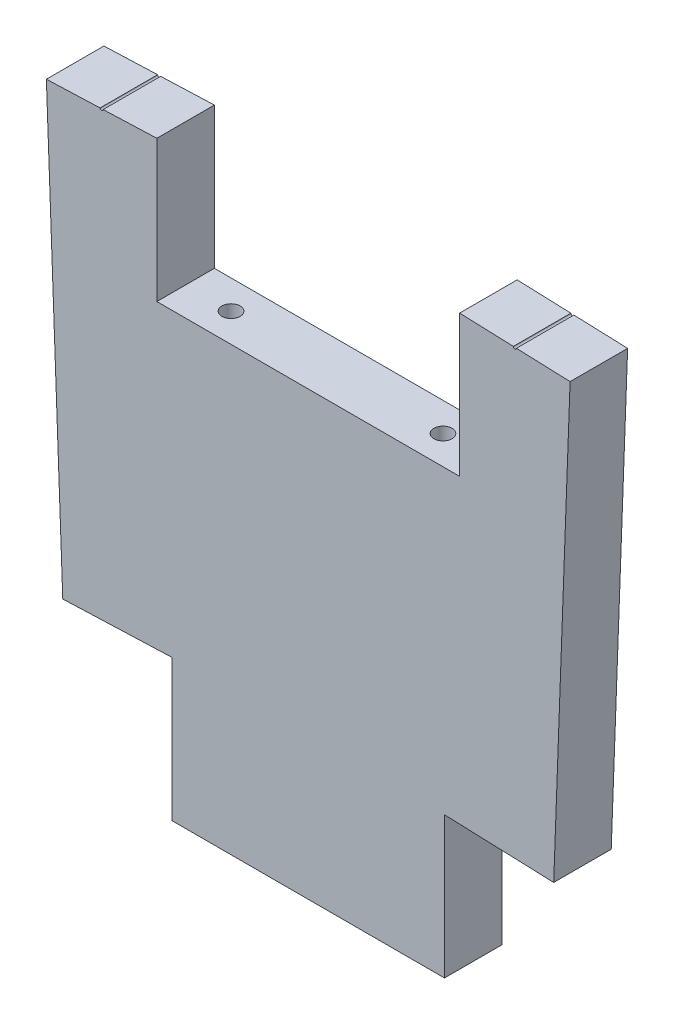
ISO-10303-21;
HEADER;
FILE_DESCRIPTION(('STEP AP214'),'2;1');
FILE_NAME('part.step','',(''),(''),'','','');
FILE_SCHEMA(('AUTOMOTIVE_DESIGN { 1 0 10303 214 1 1 1 1 }'));
ENDSEC;
DATA;
#1=APPLICATION_CONTEXT('core data for automotive mechanical design processes');
#2=APPLICATION_PROTOCOL_DEFINITION('international standard','automotive_design',2000,#1);
#3=PRODUCT_CONTEXT('',#1,'mechanical');
#4=PRODUCT('Part','Part','',(#3));
#5=PRODUCT_RELATED_PRODUCT_CATEGORY('part','',(#4));
#6=PRODUCT_DEFINITION_FORMATION('','',#4);
#7=PRODUCT_DEFINITION_CONTEXT('part definition',#1,'design');
#8=PRODUCT_DEFINITION('design','',#6,#7);
#9=PRODUCT_DEFINITION_SHAPE('','',#8);
#10=(LENGTH_UNIT() NAMED_UNIT(*) SI_UNIT(.MILLI.,.METRE.));
#11=(NAMED_UNIT(*) PLANE_ANGLE_UNIT() SI_UNIT($,.RADIAN.));
#12=(NAMED_UNIT(*) SI_UNIT($,.STERADIAN.) SOLID_ANGLE_UNIT());
#13=UNCERTAINTY_MEASURE_WITH_UNIT(LENGTH_MEASURE(1.E-05),#10,'distance_accuracy_value','');
#14=(GEOMETRIC_REPRESENTATION_CONTEXT(3) GLOBAL_UNCERTAINTY_ASSIGNED_CONTEXT((#13)) GLOBAL_UNIT_ASSIGNED_CONTEXT((#10,
#11,#12)) REPRESENTATION_CONTEXT('',''));
#15=CARTESIAN_POINT('',(0.,0.,0.));
#16=DIRECTION('',(0.,0.,1.));
#17=DIRECTION('',(1.,0.,0.));
#18=AXIS2_PLACEMENT_3D('',#15,#16,#17);
#19=CARTESIAN_POINT('',(50.,34.0019884064074,-19.));
#20=DIRECTION('',(0.0370775576868272,0.999312390954891,0.));
#21=DIRECTION('',(-0.999312390954891,0.0370775576868272,0.));
#22=AXIS2_PLACEMENT_3D('',#19,#20,#21);
#23=PLANE('',#22);
#24=DIRECTION('',(0.,0.,-1.));
#25=VECTOR('',#24,1.);
#26=CARTESIAN_POINT('',(68.7441334339807,33.306523509766,1.));
#27=LINE('',#26,#25);
#28=CARTESIAN_POINT('',(68.7441334339807,33.306523509766,0.));
#29=VERTEX_POINT('',#28);
#30=CARTESIAN_POINT('',(68.7441334339807,33.306523509766,-19.));
#31=VERTEX_POINT('',#30);
#32=EDGE_CURVE('E145',#29,#31,#27,.T.);
#33=ORIENTED_EDGE('',*,*,#32,.F.);
#34=DIRECTION('',(-0.999312390954891,0.0370775576868272,0.));
#35=VECTOR('',#34,1.);
#36=CARTESIAN_POINT('',(50.,34.0019884064074,0.));
#37=LINE('',#36,#35);
#38=CARTESIAN_POINT('',(86.4889544770109,32.6481361708111,0.));
#39=VERTEX_POINT('',#38);
#40=EDGE_CURVE('E198',#39,#29,#37,.T.);
#41=ORIENTED_EDGE('',*,*,#40,.F.);
#42=DIRECTION('',(0.,0.,1.));
#43=VECTOR('',#42,1.);
#44=CARTESIAN_POINT('',(86.4889544770109,32.6481361708111,-19.));
#45=LINE('',#44,#43);
#46=CARTESIAN_POINT('',(86.4889544770109,32.6481361708111,-19.));
#47=VERTEX_POINT('',#46);
#48=EDGE_CURVE('E166',#47,#39,#45,.T.);
#49=ORIENTED_EDGE('',*,*,#48,.F.);
#50=DIRECTION('',(-0.999312390954891,0.0370775576868272,0.));
#51=VECTOR('',#50,1.);
#52=CARTESIAN_POINT('',(50.,34.0019884064074,-19.));
#53=LINE('',#52,#51);
#54=EDGE_CURVE('E160',#47,#31,#53,.T.);
#55=ORIENTED_EDGE('',*,*,#54,.T.);
#56=EDGE_LOOP('',(#33,#41,#49,#55));
#57=FACE_BOUND('',#56,.T.);
#58=ADVANCED_FACE('F35',(#57),#23,.T.);
#59=CARTESIAN_POINT('',(-50.,34.0019884064074,-19.));
#60=DIRECTION('',(-0.0370775576868272,0.999312390954891,0.));
#61=DIRECTION('',(-0.999312390954891,-0.0370775576868272,0.));
#62=AXIS2_PLACEMENT_3D('',#59,#60,#61);
#63=PLANE('',#62);
#64=DIRECTION('',(0.,0.,-1.));
#65=VECTOR('',#64,1.);
#66=CARTESIAN_POINT('',(-67.7448210430304,33.3436010674526,1.));
#67=LINE('',#66,#65);
#68=CARTESIAN_POINT('',(-67.7448210430304,33.3436010674526,0.));
#69=VERTEX_POINT('',#68);
#70=CARTESIAN_POINT('',(-67.7448210430304,33.3436010674526,-19.));
#71=VERTEX_POINT('',#70);
#72=EDGE_CURVE('E214',#69,#71,#67,.T.);
#73=ORIENTED_EDGE('',*,*,#72,.F.);
#74=DIRECTION('',(-0.999312390954891,-0.0370775576868272,0.));
#75=VECTOR('',#74,1.);
#76=CARTESIAN_POINT('',(-50.,34.0019884064074,0.));
#77=LINE('',#76,#75);
#78=CARTESIAN_POINT('',(-50.,34.0019884064074,0.));
#79=VERTEX_POINT('',#78);
#80=EDGE_CURVE('E186',#79,#69,#77,.T.);
#81=ORIENTED_EDGE('',*,*,#80,.F.);
#82=DIRECTION('',(0.,0.,1.));
#83=VECTOR('',#82,1.);
#84=CARTESIAN_POINT('',(-50.,34.0019884064074,-19.));
#85=LINE('',#84,#83);
#86=CARTESIAN_POINT('',(-50.,34.0019884064074,-19.));
#87=VERTEX_POINT('',#86);
#88=EDGE_CURVE('E209',#87,#79,#85,.T.);
#89=ORIENTED_EDGE('',*,*,#88,.F.);
#90=DIRECTION('',(-0.999312390954891,-0.0370775576868272,0.));
#91=VECTOR('',#90,1.);
#92=CARTESIAN_POINT('',(-50.,34.0019884064074,-19.));
#93=LINE('',#92,#91);
#94=EDGE_CURVE('E223',#87,#71,#93,.T.);
#95=ORIENTED_EDGE('',*,*,#94,.T.);
#96=EDGE_LOOP('',(#73,#81,#89,#95));
#97=FACE_BOUND('',#96,.T.);
#98=ADVANCED_FACE('F221',(#97),#63,.T.);
#99=CARTESIAN_POINT('',(50.,-12.7,-19.));
#100=DIRECTION('',(-1.,0.,0.));
#101=DIRECTION('',(0.,0.,1.));
#102=AXIS2_PLACEMENT_3D('',#99,#100,#101);
#103=PLANE('',#102);
#104=DIRECTION('',(0.,-1.,0.));
#105=VECTOR('',#104,1.);
#106=CARTESIAN_POINT('',(50.,-12.7,0.));
#107=LINE('',#106,#105);
#108=CARTESIAN_POINT('',(50.,34.0019884064074,0.));
#109=VERTEX_POINT('',#108);
#110=CARTESIAN_POINT('',(50.,-12.7,0.));
#111=VERTEX_POINT('',#110);
#112=EDGE_CURVE('E175',#109,#111,#107,.T.);
#113=ORIENTED_EDGE('',*,*,#112,.F.);
#114=DIRECTION('',(0.,0.,1.));
#115=VECTOR('',#114,1.);
#116=CARTESIAN_POINT('',(50.,34.0019884064074,-19.));
#117=LINE('',#116,#115);
#118=CARTESIAN_POINT('',(50.,34.0019884064074,-19.));
#119=VERTEX_POINT('',#118);
#120=EDGE_CURVE('E201',#119,#109,#117,.T.);
#121=ORIENTED_EDGE('',*,*,#120,.F.);
#122=DIRECTION('',(0.,-1.,0.));
#123=VECTOR('',#122,1.);
#124=CARTESIAN_POINT('',(50.,-12.7,-19.));
#125=LINE('',#124,#123);
#126=CARTESIAN_POINT('',(50.,-12.7,-19.));
#127=VERTEX_POINT('',#126);
#128=EDGE_CURVE('E200',#119,#127,#125,.T.);
#129=ORIENTED_EDGE('',*,*,#128,.T.);
#130=DIRECTION('',(0.,0.,1.));
#131=VECTOR('',#130,1.);
#132=CARTESIAN_POINT('',(50.,-12.7,-19.));
#133=LINE('',#132,#131);
#134=EDGE_CURVE('E167',#127,#111,#133,.T.);
#135=ORIENTED_EDGE('',*,*,#134,.T.);
#136=EDGE_LOOP('',(#113,#121,#129,#135));
#137=FACE_BOUND('',#136,.T.);
#138=ADVANCED_FACE('F37',(#137),#103,.T.);
#139=DIRECTION('',(0.,0.,-1.));
#140=VECTOR('',#139,1.);
#141=CARTESIAN_POINT('',(67.7448210430304,33.3436010674526,1.));
#142=LINE('',#141,#140);
#143=CARTESIAN_POINT('',(67.7448210430304,33.3436010674526,-19.));
#144=VERTEX_POINT('',#143);
#145=CARTESIAN_POINT('',(67.7448210430304,33.3436010674526,0.));
#146=VERTEX_POINT('',#145);
#147=EDGE_CURVE('E49',#144,#146,#142,.F.);
#148=ORIENTED_EDGE('',*,*,#147,.F.);
#149=EDGE_CURVE('E162',#144,#119,#53,.T.);
#150=ORIENTED_EDGE('',*,*,#149,.T.);
#151=ORIENTED_EDGE('',*,*,#120,.T.);
#152=EDGE_CURVE('E197',#146,#109,#37,.T.);
#153=ORIENTED_EDGE('',*,*,#152,.F.);
#154=EDGE_LOOP('',(#148,#150,#151,#153));
#155=FACE_BOUND('',#154,.T.);
#156=ADVANCED_FACE('F291',(#155),#23,.T.);
#157=CARTESIAN_POINT('',(86.4889544770109,32.6481361708111,-19.));
#158=DIRECTION('',(0.999312390954891,-0.0370775576868271,0.));
#159=DIRECTION('',(0.0370775576868271,0.999312390954891,0.));
#160=AXIS2_PLACEMENT_3D('',#157,#158,#159);
#161=PLANE('',#160);
#162=DIRECTION('',(0.,0.,1.));
#163=VECTOR('',#162,1.);
#164=CARTESIAN_POINT('',(81.0727891717856,-113.328067188846,-19.));
#165=LINE('',#164,#163);
#166=CARTESIAN_POINT('',(81.0727891717856,-113.328067188846,-19.));
#167=VERTEX_POINT('',#166);
#168=CARTESIAN_POINT('',(81.0727891717856,-113.328067188846,0.));
#169=VERTEX_POINT('',#168);
#170=EDGE_CURVE('E179',#167,#169,#165,.T.);
#171=ORIENTED_EDGE('',*,*,#170,.F.);
#172=DIRECTION('',(0.0370775576868271,0.99931239095489,0.));
#173=VECTOR('',#172,1.);
#174=CARTESIAN_POINT('',(86.4889544770109,32.6481361708111,-19.));
#175=LINE('',#174,#173);
#176=EDGE_CURVE('E171',#167,#47,#175,.T.);
#177=ORIENTED_EDGE('',*,*,#176,.T.);
#178=ORIENTED_EDGE('',*,*,#48,.T.);
#179=DIRECTION('',(0.0370775576868271,0.99931239095489,0.));
#180=VECTOR('',#179,1.);
#181=CARTESIAN_POINT('',(86.4889544770109,32.6481361708111,0.));
#182=LINE('',#181,#180);
#183=EDGE_CURVE('E195',#169,#39,#182,.T.);
#184=ORIENTED_EDGE('',*,*,#183,.F.);
#185=EDGE_LOOP('',(#171,#177,#178,#184));
#186=FACE_BOUND('',#185,.T.);
#187=ADVANCED_FACE('F252',(#186),#161,.T.);
#188=CARTESIAN_POINT('',(79.3896611879394,-158.691644370145,-19.));
#189=DIRECTION('',(0.,-1.,0.));
#190=DIRECTION('',(0.,0.,-1.));
#191=AXIS2_PLACEMENT_3D('',#188,#189,#190);
#192=PLANE('',#191);
#193=DIRECTION('',(0.,0.,-1.));
#194=VECTOR('',#193,1.);
#195=CARTESIAN_POINT('',(45.,-158.691644370145,0.));
#196=LINE('',#195,#194);
#197=CARTESIAN_POINT('',(45.,-158.691644370145,0.));
#198=VERTEX_POINT('',#197);
#199=CARTESIAN_POINT('',(45.,-158.691644370145,-19.));
#200=VERTEX_POINT('',#199);
#201=EDGE_CURVE('E272',#198,#200,#196,.T.);
#202=ORIENTED_EDGE('',*,*,#201,.F.);
#203=DIRECTION('',(1.,0.,0.));
#204=VECTOR('',#203,1.);
#205=CARTESIAN_POINT('',(79.3896611879394,-158.691644370145,0.));
#206=LINE('',#205,#204);
#207=CARTESIAN_POINT('',(-45.0000000000001,-158.691644370145,0.));
#208=VERTEX_POINT('',#207);
#209=EDGE_CURVE('E192',#208,#198,#206,.T.);
#210=ORIENTED_EDGE('',*,*,#209,.F.);
#211=DIRECTION('',(0.,0.,-1.));
#212=VECTOR('',#211,1.);
#213=CARTESIAN_POINT('',(-45.0000000000001,-158.691644370145,0.));
#214=LINE('',#213,#212);
#215=CARTESIAN_POINT('',(-45.0000000000001,-158.691644370145,-19.));
#216=VERTEX_POINT('',#215);
#217=EDGE_CURVE('E274',#208,#216,#214,.T.);
#218=ORIENTED_EDGE('',*,*,#217,.T.);
#219=DIRECTION('',(1.,0.,0.));
#220=VECTOR('',#219,1.);
#221=CARTESIAN_POINT('',(79.3896611879394,-158.691644370145,-19.));
#222=LINE('',#221,#220);
#223=EDGE_CURVE('E241',#216,#200,#222,.T.);
#224=ORIENTED_EDGE('',*,*,#223,.T.);
#225=EDGE_LOOP('',(#202,#210,#218,#224));
#226=FACE_BOUND('',#225,.T.);
#227=ADVANCED_FACE('F318',(#226),#192,.T.);
#228=CARTESIAN_POINT('',(-86.4889544770109,32.6481361708111,-19.));
#229=DIRECTION('',(-0.999312390954891,-0.0370775576868271,0.));
#230=DIRECTION('',(0.0370775576868271,-0.999312390954891,0.));
#231=AXIS2_PLACEMENT_3D('',#228,#229,#230);
#232=PLANE('',#231);
#233=DIRECTION('',(0.,0.,-1.));
#234=VECTOR('',#233,1.);
#235=CARTESIAN_POINT('',(-81.0727891717856,-113.328067188845,-19.));
#236=LINE('',#235,#234);
#237=CARTESIAN_POINT('',(-81.0727891717856,-113.328067188845,0.));
#238=VERTEX_POINT('',#237);
#239=CARTESIAN_POINT('',(-81.0727891717856,-113.328067188845,-19.));
#240=VERTEX_POINT('',#239);
#241=EDGE_CURVE('E271',#238,#240,#236,.T.);
#242=ORIENTED_EDGE('',*,*,#241,.F.);
#243=DIRECTION('',(0.0370775576868271,-0.99931239095489,0.));
#244=VECTOR('',#243,1.);
#245=CARTESIAN_POINT('',(-86.4889544770109,32.6481361708111,0.));
#246=LINE('',#245,#244);
#247=CARTESIAN_POINT('',(-86.4889544770109,32.6481361708111,0.));
#248=VERTEX_POINT('',#247);
#249=EDGE_CURVE('E189',#248,#238,#246,.T.);
#250=ORIENTED_EDGE('',*,*,#249,.F.);
#251=DIRECTION('',(0.,0.,1.));
#252=VECTOR('',#251,1.);
#253=CARTESIAN_POINT('',(-86.4889544770109,32.6481361708111,-19.));
#254=LINE('',#253,#252);
#255=CARTESIAN_POINT('',(-86.4889544770109,32.6481361708111,-19.));
#256=VERTEX_POINT('',#255);
#257=EDGE_CURVE('E206',#256,#248,#254,.T.);
#258=ORIENTED_EDGE('',*,*,#257,.F.);
#259=DIRECTION('',(0.0370775576868271,-0.99931239095489,0.));
#260=VECTOR('',#259,1.);
#261=CARTESIAN_POINT('',(-86.4889544770109,32.6481361708111,-19.));
#262=LINE('',#261,#260);
#263=EDGE_CURVE('E237',#256,#240,#262,.T.);
#264=ORIENTED_EDGE('',*,*,#263,.T.);
#265=EDGE_LOOP('',(#242,#250,#258,#264));
#266=FACE_BOUND('',#265,.T.);
#267=ADVANCED_FACE('F326',(#266),#232,.T.);
#268=DIRECTION('',(0.,0.,-1.));
#269=VECTOR('',#268,1.);
#270=CARTESIAN_POINT('',(-68.7441334339807,33.306523509766,1.));
#271=LINE('',#270,#269);
#272=CARTESIAN_POINT('',(-68.7441334339807,33.306523509766,-19.));
#273=VERTEX_POINT('',#272);
#274=CARTESIAN_POINT('',(-68.7441334339807,33.306523509766,0.));
#275=VERTEX_POINT('',#274);
#276=EDGE_CURVE('E57',#273,#275,#271,.F.);
#277=ORIENTED_EDGE('',*,*,#276,.F.);
#278=EDGE_CURVE('E238',#273,#256,#93,.T.);
#279=ORIENTED_EDGE('',*,*,#278,.T.);
#280=ORIENTED_EDGE('',*,*,#257,.T.);
#281=EDGE_CURVE('E185',#275,#248,#77,.T.);
#282=ORIENTED_EDGE('',*,*,#281,.F.);
#283=EDGE_LOOP('',(#277,#279,#280,#282));
#284=FACE_BOUND('',#283,.T.);
#285=ADVANCED_FACE('F329',(#284),#63,.T.);
#286=CARTESIAN_POINT('',(-50.,-12.7,-19.));
#287=DIRECTION('',(1.,0.,0.));
#288=DIRECTION('',(0.,0.,-1.));
#289=AXIS2_PLACEMENT_3D('',#286,#287,#288);
#290=PLANE('',#289);
#291=DIRECTION('',(0.,1.,0.));
#292=VECTOR('',#291,1.);
#293=CARTESIAN_POINT('',(-50.,-12.7,0.));
#294=LINE('',#293,#292);
#295=CARTESIAN_POINT('',(-50.,-12.7,0.));
#296=VERTEX_POINT('',#295);
#297=EDGE_CURVE('E182',#296,#79,#294,.T.);
#298=ORIENTED_EDGE('',*,*,#297,.F.);
#299=DIRECTION('',(0.,0.,1.));
#300=VECTOR('',#299,1.);
#301=CARTESIAN_POINT('',(-50.,-12.7,-19.));
#302=LINE('',#301,#300);
#303=CARTESIAN_POINT('',(-50.,-12.7,-19.));
#304=VERTEX_POINT('',#303);
#305=EDGE_CURVE('E169',#304,#296,#302,.T.);
#306=ORIENTED_EDGE('',*,*,#305,.F.);
#307=DIRECTION('',(0.,1.,0.));
#308=VECTOR('',#307,1.);
#309=CARTESIAN_POINT('',(-50.,-12.7,-19.));
#310=LINE('',#309,#308);
#311=EDGE_CURVE('E233',#304,#87,#310,.T.);
#312=ORIENTED_EDGE('',*,*,#311,.T.);
#313=ORIENTED_EDGE('',*,*,#88,.T.);
#314=EDGE_LOOP('',(#298,#306,#312,#313));
#315=FACE_BOUND('',#314,.T.);
#316=ADVANCED_FACE('F230',(#315),#290,.T.);
#317=CARTESIAN_POINT('',(-50.,-12.7,-19.));
#318=DIRECTION('',(0.,1.,0.));
#319=DIRECTION('',(0.,0.,1.));
#320=AXIS2_PLACEMENT_3D('',#317,#318,#319);
#321=PLANE('',#320);
#322=CARTESIAN_POINT('',(-35.0000000000022,-12.7,-9.5000000000004));
#323=DIRECTION('',(0.,1.,0.));
#324=DIRECTION('',(0.,0.,1.));
#325=AXIS2_PLACEMENT_3D('',#322,#323,#324);
#326=CIRCLE('',#325,3.);
#327=CARTESIAN_POINT('',(-35.0000000000022,-12.7,-6.5000000000004));
#328=VERTEX_POINT('',#327);
#329=EDGE_CURVE('E224',#328,#328,#326,.T.);
#330=ORIENTED_EDGE('',*,*,#329,.F.);
#331=EDGE_LOOP('',(#330));
#332=FACE_BOUND('',#331,.T.);
#333=CARTESIAN_POINT('',(34.9999999999978,-12.7,-9.5000000000004));
#334=DIRECTION('',(0.,1.,0.));
#335=DIRECTION('',(0.,0.,1.));
#336=AXIS2_PLACEMENT_3D('',#333,#334,#335);
#337=CIRCLE('',#336,3.);
#338=CARTESIAN_POINT('',(34.9999999999978,-12.7,-6.5000000000004));
#339=VERTEX_POINT('',#338);
#340=EDGE_CURVE('E299',#339,#339,#337,.T.);
#341=ORIENTED_EDGE('',*,*,#340,.F.);
#342=EDGE_LOOP('',(#341));
#343=FACE_BOUND('',#342,.T.);
#344=DIRECTION('',(-1.,0.,0.));
#345=VECTOR('',#344,1.);
#346=CARTESIAN_POINT('',(-50.,-12.7,0.));
#347=LINE('',#346,#345);
#348=EDGE_CURVE('E178',#111,#296,#347,.T.);
#349=ORIENTED_EDGE('',*,*,#348,.F.);
#350=ORIENTED_EDGE('',*,*,#134,.F.);
#351=DIRECTION('',(-1.,0.,0.));
#352=VECTOR('',#351,1.);
#353=CARTESIAN_POINT('',(-50.,-12.7,-19.));
#354=LINE('',#353,#352);
#355=EDGE_CURVE('E283',#127,#304,#354,.T.);
#356=ORIENTED_EDGE('',*,*,#355,.T.);
#357=ORIENTED_EDGE('',*,*,#305,.T.);
#358=EDGE_LOOP('',(#349,#350,#356,#357));
#359=FACE_BOUND('',#358,.T.);
#360=ADVANCED_FACE('F285',(#332,#343,#359),#321,.T.);
#361=CARTESIAN_POINT('',(50.,-158.691644370145,-19.));
#362=DIRECTION('',(0.,0.,1.));
#363=DIRECTION('',(1.,0.,0.));
#364=AXIS2_PLACEMENT_3D('',#361,#362,#363);
#365=PLANE('',#364);
#366=ORIENTED_EDGE('',*,*,#149,.F.);
#367=CARTESIAN_POINT('',(68.2444772385055,33.3250622886078,-19.));
#368=DIRECTION('',(0.,0.,-1.));
#369=DIRECTION('',(1.,0.,0.));
#370=AXIS2_PLACEMENT_3D('',#367,#368,#369);
#371=CIRCLE('',#370,0.499999999997695);
#372=EDGE_CURVE('E148',#31,#144,#371,.T.);
#373=ORIENTED_EDGE('',*,*,#372,.F.);
#374=ORIENTED_EDGE('',*,*,#54,.F.);
#375=ORIENTED_EDGE('',*,*,#176,.F.);
#376=DIRECTION('',(0.999312390954891,-0.0370775576868234,0.));
#377=VECTOR('',#376,1.);
#378=CARTESIAN_POINT('',(45.,-111.98965596374,-19.));
#379=LINE('',#378,#377);
#380=CARTESIAN_POINT('',(45.,-111.98965596374,-19.));
#381=VERTEX_POINT('',#380);
#382=EDGE_CURVE('E256',#381,#167,#379,.T.);
#383=ORIENTED_EDGE('',*,*,#382,.F.);
#384=DIRECTION('',(0.,1.,0.));
#385=VECTOR('',#384,1.);
#386=CARTESIAN_POINT('',(45.,-158.691644370145,-19.));
#387=LINE('',#386,#385);
#388=EDGE_CURVE('E258',#200,#381,#387,.T.);
#389=ORIENTED_EDGE('',*,*,#388,.F.);
#390=ORIENTED_EDGE('',*,*,#223,.F.);
#391=DIRECTION('',(0.,-1.,0.));
#392=VECTOR('',#391,1.);
#393=CARTESIAN_POINT('',(-45.,-111.98965596374,-19.));
#394=LINE('',#393,#392);
#395=CARTESIAN_POINT('',(-45.,-111.98965596374,-19.));
#396=VERTEX_POINT('',#395);
#397=EDGE_CURVE('E265',#396,#216,#394,.T.);
#398=ORIENTED_EDGE('',*,*,#397,.F.);
#399=DIRECTION('',(0.999312390954891,0.0370775576868042,0.));
#400=VECTOR('',#399,1.);
#401=CARTESIAN_POINT('',(-176.999986596092,-116.887260718743,-19.));
#402=LINE('',#401,#400);
#403=EDGE_CURVE('E305',#240,#396,#402,.T.);
#404=ORIENTED_EDGE('',*,*,#403,.F.);
#405=ORIENTED_EDGE('',*,*,#263,.F.);
#406=ORIENTED_EDGE('',*,*,#278,.F.);
#407=CARTESIAN_POINT('',(-68.2444772385055,33.3250622886078,-19.));
#408=DIRECTION('',(0.,0.,-1.));
#409=DIRECTION('',(-1.,0.,0.));
#410=AXIS2_PLACEMENT_3D('',#407,#408,#409);
#411=CIRCLE('',#410,0.499999999997695);
#412=EDGE_CURVE('E153',#71,#273,#411,.T.);
#413=ORIENTED_EDGE('',*,*,#412,.F.);
#414=ORIENTED_EDGE('',*,*,#94,.F.);
#415=ORIENTED_EDGE('',*,*,#311,.F.);
#416=ORIENTED_EDGE('',*,*,#355,.F.);
#417=ORIENTED_EDGE('',*,*,#128,.F.);
#418=EDGE_LOOP('',(#366,#373,#374,#375,#383,#389,#390,#398,#404,#405,#406,#413,#414,#415,#416,#417));
#419=FACE_BOUND('',#418,.T.);
#420=ADVANCED_FACE('F158',(#419),#365,.F.);
#421=CARTESIAN_POINT('',(50.,-158.691644370145,0.));
#422=DIRECTION('',(0.,0.,1.));
#423=DIRECTION('',(1.,0.,0.));
#424=AXIS2_PLACEMENT_3D('',#421,#422,#423);
#425=PLANE('',#424);
#426=CARTESIAN_POINT('',(68.2444772385055,33.3250622886078,0.));
#427=DIRECTION('',(0.,0.,1.));
#428=DIRECTION('',(1.,0.,0.));
#429=AXIS2_PLACEMENT_3D('',#426,#427,#428);
#430=CIRCLE('',#429,0.499999999997695);
#431=EDGE_CURVE('E11',#146,#29,#430,.T.);
#432=ORIENTED_EDGE('',*,*,#431,.F.);
#433=ORIENTED_EDGE('',*,*,#152,.T.);
#434=ORIENTED_EDGE('',*,*,#112,.T.);
#435=ORIENTED_EDGE('',*,*,#348,.T.);
#436=ORIENTED_EDGE('',*,*,#297,.T.);
#437=ORIENTED_EDGE('',*,*,#80,.T.);
#438=CARTESIAN_POINT('',(-68.2444772385055,33.3250622886078,0.));
#439=DIRECTION('',(0.,0.,1.));
#440=DIRECTION('',(1.,0.,0.));
#441=AXIS2_PLACEMENT_3D('',#438,#439,#440);
#442=CIRCLE('',#441,0.499999999997695);
#443=EDGE_CURVE('E43',#275,#69,#442,.T.);
#444=ORIENTED_EDGE('',*,*,#443,.F.);
#445=ORIENTED_EDGE('',*,*,#281,.T.);
#446=ORIENTED_EDGE('',*,*,#249,.T.);
#447=DIRECTION('',(-0.999312390954892,-0.0370775576868042,0.));
#448=VECTOR('',#447,1.);
#449=CARTESIAN_POINT('',(48.138994189636,-108.533913333893,0.));
#450=LINE('',#449,#448);
#451=CARTESIAN_POINT('',(-45.,-111.98965596374,0.));
#452=VERTEX_POINT('',#451);
#453=EDGE_CURVE('E204',#452,#238,#450,.T.);
#454=ORIENTED_EDGE('',*,*,#453,.F.);
#455=DIRECTION('',(0.,-1.,0.));
#456=VECTOR('',#455,1.);
#457=CARTESIAN_POINT('',(-45.,-111.98965596374,0.));
#458=LINE('',#457,#456);
#459=EDGE_CURVE('E260',#452,#208,#458,.T.);
#460=ORIENTED_EDGE('',*,*,#459,.T.);
#461=ORIENTED_EDGE('',*,*,#209,.T.);
#462=DIRECTION('',(0.,1.,0.));
#463=VECTOR('',#462,1.);
#464=CARTESIAN_POINT('',(45.,-158.691644370145,0.));
#465=LINE('',#464,#463);
#466=CARTESIAN_POINT('',(45.,-111.98965596374,0.));
#467=VERTEX_POINT('',#466);
#468=EDGE_CURVE('E263',#198,#467,#465,.T.);
#469=ORIENTED_EDGE('',*,*,#468,.T.);
#470=DIRECTION('',(0.999312390954891,-0.0370775576868234,0.));
#471=VECTOR('',#470,1.);
#472=CARTESIAN_POINT('',(45.,-111.98965596374,0.));
#473=LINE('',#472,#471);
#474=EDGE_CURVE('E279',#467,#169,#473,.T.);
#475=ORIENTED_EDGE('',*,*,#474,.T.);
#476=ORIENTED_EDGE('',*,*,#183,.T.);
#477=ORIENTED_EDGE('',*,*,#40,.T.);
#478=EDGE_LOOP('',(#432,#433,#434,#435,#436,#437,#444,#445,#446,#454,#460,#461,#469,#475,#476,#477));
#479=FACE_BOUND('',#478,.T.);
#480=ADVANCED_FACE('F226',(#479),#425,.T.);
#481=CARTESIAN_POINT('',(-176.999986596092,-116.887260718743,0.));
#482=DIRECTION('',(-0.0370775576868042,0.999312390954891,0.));
#483=DIRECTION('',(-0.999312390954892,-0.0370775576868042,0.));
#484=AXIS2_PLACEMENT_3D('',#481,#482,#483);
#485=PLANE('',#484);
#486=ORIENTED_EDGE('',*,*,#241,.T.);
#487=ORIENTED_EDGE('',*,*,#403,.T.);
#488=DIRECTION('',(0.,0.,-1.));
#489=VECTOR('',#488,1.);
#490=CARTESIAN_POINT('',(-45.,-111.98965596374,0.));
#491=LINE('',#490,#489);
#492=EDGE_CURVE('E276',#452,#396,#491,.T.);
#493=ORIENTED_EDGE('',*,*,#492,.F.);
#494=ORIENTED_EDGE('',*,*,#453,.T.);
#495=EDGE_LOOP('',(#486,#487,#493,#494));
#496=FACE_BOUND('',#495,.T.);
#497=ADVANCED_FACE('F321',(#496),#485,.F.);
#498=CARTESIAN_POINT('',(-45.,-111.98965596374,0.));
#499=DIRECTION('',(1.,0.,0.));
#500=DIRECTION('',(0.,1.,0.));
#501=AXIS2_PLACEMENT_3D('',#498,#499,#500);
#502=PLANE('',#501);
#503=ORIENTED_EDGE('',*,*,#397,.T.);
#504=ORIENTED_EDGE('',*,*,#217,.F.);
#505=ORIENTED_EDGE('',*,*,#459,.F.);
#506=ORIENTED_EDGE('',*,*,#492,.T.);
#507=EDGE_LOOP('',(#503,#504,#505,#506));
#508=FACE_BOUND('',#507,.T.);
#509=ADVANCED_FACE('F314',(#508),#502,.F.);
#510=CARTESIAN_POINT('',(45.,-111.98965596374,0.));
#511=DIRECTION('',(0.0370775576868234,0.999312390954891,0.));
#512=DIRECTION('',(-0.999312390954891,0.0370775576868234,0.));
#513=AXIS2_PLACEMENT_3D('',#510,#511,#512);
#514=PLANE('',#513);
#515=ORIENTED_EDGE('',*,*,#170,.T.);
#516=ORIENTED_EDGE('',*,*,#474,.F.);
#517=DIRECTION('',(0.,0.,-1.));
#518=VECTOR('',#517,1.);
#519=CARTESIAN_POINT('',(45.,-111.98965596374,0.));
#520=LINE('',#519,#518);
#521=EDGE_CURVE('E269',#467,#381,#520,.T.);
#522=ORIENTED_EDGE('',*,*,#521,.T.);
#523=ORIENTED_EDGE('',*,*,#382,.T.);
#524=EDGE_LOOP('',(#515,#516,#522,#523));
#525=FACE_BOUND('',#524,.T.);
#526=ADVANCED_FACE('F429',(#525),#514,.F.);
#527=CARTESIAN_POINT('',(45.,-158.691644370145,0.));
#528=DIRECTION('',(-1.,0.,0.));
#529=DIRECTION('',(0.,0.,1.));
#530=AXIS2_PLACEMENT_3D('',#527,#528,#529);
#531=PLANE('',#530);
#532=ORIENTED_EDGE('',*,*,#388,.T.);
#533=ORIENTED_EDGE('',*,*,#521,.F.);
#534=ORIENTED_EDGE('',*,*,#468,.F.);
#535=ORIENTED_EDGE('',*,*,#201,.T.);
#536=EDGE_LOOP('',(#532,#533,#534,#535));
#537=FACE_BOUND('',#536,.T.);
#538=ADVANCED_FACE('F427',(#537),#531,.F.);
#539=CARTESIAN_POINT('',(34.9999999999978,-22.7,-9.5000000000004));
#540=DIRECTION('',(0.,1.,0.));
#541=DIRECTION('',(0.,0.,1.));
#542=AXIS2_PLACEMENT_3D('',#539,#540,#541);
#543=CYLINDRICAL_SURFACE('',#542,3.);
#544=CARTESIAN_POINT('',(34.9999999999978,-22.7,-9.5000000000004));
#545=DIRECTION('',(0.,1.,0.));
#546=DIRECTION('',(0.,0.,1.));
#547=AXIS2_PLACEMENT_3D('',#544,#545,#546);
#548=CIRCLE('',#547,3.);
#549=CARTESIAN_POINT('',(34.9999999999978,-22.7,-6.5000000000004));
#550=VERTEX_POINT('',#549);
#551=EDGE_CURVE('E302',#550,#550,#548,.T.);
#552=ORIENTED_EDGE('',*,*,#551,.F.);
#553=EDGE_LOOP('',(#552));
#554=FACE_BOUND('',#553,.T.);
#555=ORIENTED_EDGE('',*,*,#340,.T.);
#556=EDGE_LOOP('',(#555));
#557=FACE_BOUND('',#556,.T.);
#558=ADVANCED_FACE('F423',(#554,#557),#543,.F.);
#559=CARTESIAN_POINT('',(34.9999999999978,-22.7,-9.5000000000004));
#560=DIRECTION('',(0.,1.,0.));
#561=DIRECTION('',(0.,0.,1.));
#562=AXIS2_PLACEMENT_3D('',#559,#560,#561);
#563=PLANE('',#562);
#564=ORIENTED_EDGE('',*,*,#551,.T.);
#565=EDGE_LOOP('',(#564));
#566=FACE_BOUND('',#565,.T.);
#567=ADVANCED_FACE('F419',(#566),#563,.T.);
#568=CARTESIAN_POINT('',(-35.0000000000022,-22.7,-9.5000000000004));
#569=DIRECTION('',(0.,1.,0.));
#570=DIRECTION('',(0.,0.,1.));
#571=AXIS2_PLACEMENT_3D('',#568,#569,#570);
#572=CYLINDRICAL_SURFACE('',#571,3.);
#573=CARTESIAN_POINT('',(-35.0000000000022,-22.7,-9.5000000000004));
#574=DIRECTION('',(0.,1.,0.));
#575=DIRECTION('',(0.,0.,1.));
#576=AXIS2_PLACEMENT_3D('',#573,#574,#575);
#577=CIRCLE('',#576,3.);
#578=CARTESIAN_POINT('',(-35.0000000000022,-22.7,-6.5000000000004));
#579=VERTEX_POINT('',#578);
#580=EDGE_CURVE('E296',#579,#579,#577,.T.);
#581=ORIENTED_EDGE('',*,*,#580,.F.);
#582=EDGE_LOOP('',(#581));
#583=FACE_BOUND('',#582,.T.);
#584=ORIENTED_EDGE('',*,*,#329,.T.);
#585=EDGE_LOOP('',(#584));
#586=FACE_BOUND('',#585,.T.);
#587=ADVANCED_FACE('F415',(#583,#586),#572,.F.);
#588=CARTESIAN_POINT('',(-35.0000000000022,-22.7,-9.5000000000004));
#589=DIRECTION('',(0.,1.,0.));
#590=DIRECTION('',(0.,0.,1.));
#591=AXIS2_PLACEMENT_3D('',#588,#589,#590);
#592=PLANE('',#591);
#593=ORIENTED_EDGE('',*,*,#580,.T.);
#594=EDGE_LOOP('',(#593));
#595=FACE_BOUND('',#594,.T.);
#596=ADVANCED_FACE('F400',(#595),#592,.T.);
#597=CARTESIAN_POINT('',(-68.2444772385055,33.3250622886078,1.));
#598=DIRECTION('',(0.,0.,-1.));
#599=DIRECTION('',(-1.,0.,0.));
#600=AXIS2_PLACEMENT_3D('',#597,#598,#599);
#601=CYLINDRICAL_SURFACE('',#600,0.499999999997695);
#602=ORIENTED_EDGE('',*,*,#72,.T.);
#603=ORIENTED_EDGE('',*,*,#412,.T.);
#604=ORIENTED_EDGE('',*,*,#276,.T.);
#605=ORIENTED_EDGE('',*,*,#443,.T.);
#606=EDGE_LOOP('',(#602,#603,#604,#605));
#607=FACE_BOUND('',#606,.T.);
#608=ADVANCED_FACE('F213',(#607),#601,.F.);
#609=CARTESIAN_POINT('',(68.2444772385055,33.3250622886078,1.));
#610=DIRECTION('',(0.,0.,-1.));
#611=DIRECTION('',(-1.,0.,0.));
#612=AXIS2_PLACEMENT_3D('',#609,#610,#611);
#613=CYLINDRICAL_SURFACE('',#612,0.499999999997695);
#614=ORIENTED_EDGE('',*,*,#32,.T.);
#615=ORIENTED_EDGE('',*,*,#372,.T.);
#616=ORIENTED_EDGE('',*,*,#147,.T.);
#617=ORIENTED_EDGE('',*,*,#431,.T.);
#618=EDGE_LOOP('',(#614,#615,#616,#617));
#619=FACE_BOUND('',#618,.T.);
#620=ADVANCED_FACE('F147',(#619),#613,.F.);
#621=CLOSED_SHELL('',(#58,#98,#138,#156,#187,#227,#267,#285,#316,#360,#420,#480,#497,#509,#526,
#538,#558,#567,#587,#596,#608,#620));
#622=MANIFOLD_SOLID_BREP('B2',#621);
#623=ADVANCED_BREP_SHAPE_REPRESENTATION('',(#18,#622),#14);
#624=SHAPE_DEFINITION_REPRESENTATION(#9,#623);
ENDSEC;
END-ISO-10303-21;
